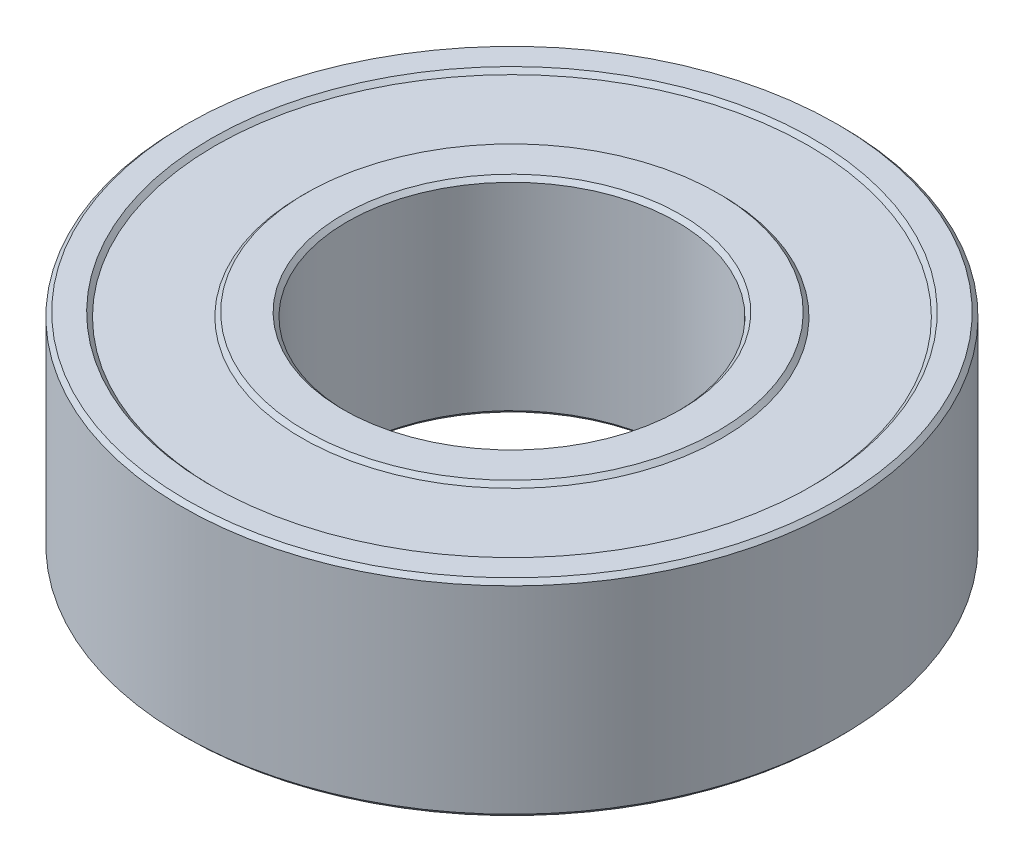
ISO-10303-21;
HEADER;
FILE_DESCRIPTION(('STEP AP214'),'2;1');
FILE_NAME('part.step','',(''),(''),'','','');
FILE_SCHEMA(('AUTOMOTIVE_DESIGN { 1 0 10303 214 1 1 1 1 }'));
ENDSEC;
DATA;
#1=APPLICATION_CONTEXT('core data for automotive mechanical design processes');
#2=APPLICATION_PROTOCOL_DEFINITION('international standard','automotive_design',2000,#1);
#3=PRODUCT_CONTEXT('',#1,'mechanical');
#4=PRODUCT('Part','Part','',(#3));
#5=PRODUCT_RELATED_PRODUCT_CATEGORY('part','',(#4));
#6=PRODUCT_DEFINITION_FORMATION('','',#4);
#7=PRODUCT_DEFINITION_CONTEXT('part definition',#1,'design');
#8=PRODUCT_DEFINITION('design','',#6,#7);
#9=PRODUCT_DEFINITION_SHAPE('','',#8);
#10=(LENGTH_UNIT() NAMED_UNIT(*) SI_UNIT(.MILLI.,.METRE.));
#11=(NAMED_UNIT(*) PLANE_ANGLE_UNIT() SI_UNIT($,.RADIAN.));
#12=(NAMED_UNIT(*) SI_UNIT($,.STERADIAN.) SOLID_ANGLE_UNIT());
#13=UNCERTAINTY_MEASURE_WITH_UNIT(LENGTH_MEASURE(1.E-05),#10,'distance_accuracy_value','');
#14=(GEOMETRIC_REPRESENTATION_CONTEXT(3) GLOBAL_UNCERTAINTY_ASSIGNED_CONTEXT((#13)) GLOBAL_UNIT_ASSIGNED_CONTEXT((#10,
#11,#12)) REPRESENTATION_CONTEXT('',''));
#15=CARTESIAN_POINT('',(0.,0.,0.));
#16=DIRECTION('',(0.,0.,1.));
#17=DIRECTION('',(1.,0.,0.));
#18=AXIS2_PLACEMENT_3D('',#15,#16,#17);
#19=CARTESIAN_POINT('',(0.,4.95,0.));
#20=DIRECTION('',(0.,1.,0.));
#21=DIRECTION('',(-1.,0.,0.));
#22=AXIS2_PLACEMENT_3D('',#19,#20,#21);
#23=CONICAL_SURFACE('',#22,4.05,0.785398163397448);
#24=CARTESIAN_POINT('',(0.,5.,0.));
#25=DIRECTION('',(0.,1.,0.));
#26=DIRECTION('',(-1.,0.,0.));
#27=AXIS2_PLACEMENT_3D('',#24,#25,#26);
#28=CIRCLE('',#27,4.1);
#29=CARTESIAN_POINT('',(4.1,5.,0.));
#30=VERTEX_POINT('',#29);
#31=EDGE_CURVE('P0_E11',#30,#30,#28,.T.);
#32=ORIENTED_EDGE('',*,*,#31,.T.);
#33=DIRECTION('',(-0.707106781186548,-0.707106781186548,0.));
#34=VECTOR('',#33,1.);
#35=CARTESIAN_POINT('',(4.05,4.95,0.));
#36=LINE('',#35,#34);
#37=CARTESIAN_POINT('',(4.,4.9,0.));
#38=VERTEX_POINT('',#37);
#39=EDGE_CURVE('P0_E27',#30,#38,#36,.T.);
#40=ORIENTED_EDGE('',*,*,#39,.T.);
#41=CARTESIAN_POINT('',(0.,4.9,0.));
#42=DIRECTION('',(0.,-1.,0.));
#43=DIRECTION('',(-1.,0.,0.));
#44=AXIS2_PLACEMENT_3D('',#41,#42,#43);
#45=CIRCLE('',#44,4.);
#46=CARTESIAN_POINT('',(-4.,4.9,0.));
#47=VERTEX_POINT('',#46);
#48=EDGE_CURVE('P0_E20',#38,#47,#45,.T.);
#49=ORIENTED_EDGE('',*,*,#48,.T.);
#50=CARTESIAN_POINT('',(0.,4.9,0.));
#51=DIRECTION('',(0.,-1.,0.));
#52=DIRECTION('',(-1.,0.,0.));
#53=AXIS2_PLACEMENT_3D('',#50,#51,#52);
#54=CIRCLE('',#53,4.);
#55=EDGE_CURVE('P0_E118',#47,#38,#54,.T.);
#56=ORIENTED_EDGE('',*,*,#55,.T.);
#57=ORIENTED_EDGE('',*,*,#39,.F.);
#58=EDGE_LOOP('',(#32,#40,#49,#56,#57));
#59=FACE_BOUND('',#58,.T.);
#60=ADVANCED_FACE('P0_F16',(#59),#23,.F.);
#61=CARTESIAN_POINT('',(0.,5.,0.));
#62=DIRECTION('',(0.,1.,0.));
#63=DIRECTION('',(1.,0.,0.));
#64=AXIS2_PLACEMENT_3D('',#61,#62,#63);
#65=PLANE('',#64);
#66=CARTESIAN_POINT('',(0.,5.,0.));
#67=DIRECTION('',(0.,-1.,0.));
#68=DIRECTION('',(-1.,0.,0.));
#69=AXIS2_PLACEMENT_3D('',#66,#67,#68);
#70=CIRCLE('',#69,5.);
#71=CARTESIAN_POINT('',(5.,5.,0.));
#72=VERTEX_POINT('',#71);
#73=EDGE_CURVE('P0_E130',#72,#72,#70,.T.);
#74=ORIENTED_EDGE('',*,*,#73,.F.);
#75=EDGE_LOOP('',(#74));
#76=FACE_BOUND('',#75,.T.);
#77=ORIENTED_EDGE('',*,*,#31,.F.);
#78=EDGE_LOOP('',(#77));
#79=FACE_BOUND('',#78,.T.);
#80=ADVANCED_FACE('P0_F296',(#76,#79),#65,.T.);
#81=CARTESIAN_POINT('',(0.,0.,0.));
#82=DIRECTION('',(0.,1.,0.));
#83=DIRECTION('',(1.,0.,0.));
#84=AXIS2_PLACEMENT_3D('',#81,#82,#83);
#85=CYLINDRICAL_SURFACE('',#84,4.);
#86=ORIENTED_EDGE('',*,*,#48,.F.);
#87=ORIENTED_EDGE('',*,*,#55,.F.);
#88=DIRECTION('',(0.,-1.,0.));
#89=VECTOR('',#88,1.);
#90=CARTESIAN_POINT('',(-4.,0.,0.));
#91=LINE('',#90,#89);
#92=CARTESIAN_POINT('',(-4.,0.1,0.));
#93=VERTEX_POINT('',#92);
#94=EDGE_CURVE('P0_E122',#47,#93,#91,.T.);
#95=ORIENTED_EDGE('',*,*,#94,.T.);
#96=CARTESIAN_POINT('',(0.,0.1,0.));
#97=DIRECTION('',(0.,1.,0.));
#98=DIRECTION('',(1.,0.,0.));
#99=AXIS2_PLACEMENT_3D('',#96,#97,#98);
#100=CIRCLE('',#99,4.);
#101=EDGE_CURVE('P0_E183',#93,#93,#100,.T.);
#102=ORIENTED_EDGE('',*,*,#101,.F.);
#103=ORIENTED_EDGE('',*,*,#94,.F.);
#104=EDGE_LOOP('',(#86,#87,#95,#102,#103));
#105=FACE_BOUND('',#104,.T.);
#106=ADVANCED_FACE('P0_F205',(#105),#85,.F.);
#107=CARTESIAN_POINT('',(0.,4.95,0.));
#108=DIRECTION('',(0.,-1.,0.));
#109=DIRECTION('',(-1.,0.,0.));
#110=AXIS2_PLACEMENT_3D('',#107,#108,#109);
#111=CONICAL_SURFACE('',#110,5.05,0.785398163397448);
#112=ORIENTED_EDGE('',*,*,#73,.T.);
#113=DIRECTION('',(0.707106781186548,-0.707106781186548,0.));
#114=VECTOR('',#113,1.);
#115=CARTESIAN_POINT('',(5.05,4.95,0.));
#116=LINE('',#115,#114);
#117=CARTESIAN_POINT('',(5.1,4.9,0.));
#118=VERTEX_POINT('',#117);
#119=EDGE_CURVE('P0_E140',#72,#118,#116,.T.);
#120=ORIENTED_EDGE('',*,*,#119,.T.);
#121=CARTESIAN_POINT('',(0.,4.9,0.));
#122=DIRECTION('',(0.,1.,0.));
#123=DIRECTION('',(-1.,0.,0.));
#124=AXIS2_PLACEMENT_3D('',#121,#122,#123);
#125=CIRCLE('',#124,5.1);
#126=EDGE_CURVE('P0_E150',#118,#118,#125,.T.);
#127=ORIENTED_EDGE('',*,*,#126,.T.);
#128=ORIENTED_EDGE('',*,*,#119,.F.);
#129=EDGE_LOOP('',(#112,#120,#127,#128));
#130=FACE_BOUND('',#129,.T.);
#131=ADVANCED_FACE('P0_F328',(#130),#111,.T.);
#132=CARTESIAN_POINT('',(0.,4.,0.));
#133=DIRECTION('',(0.,1.,0.));
#134=DIRECTION('',(-1.,0.,0.));
#135=AXIS2_PLACEMENT_3D('',#132,#133,#134);
#136=CYLINDRICAL_SURFACE('',#135,5.1);
#137=ORIENTED_EDGE('',*,*,#126,.F.);
#138=DIRECTION('',(0.,-1.,0.));
#139=VECTOR('',#138,1.);
#140=CARTESIAN_POINT('',(5.1,4.,0.));
#141=LINE('',#140,#139);
#142=CARTESIAN_POINT('',(5.1,4.,0.));
#143=VERTEX_POINT('',#142);
#144=EDGE_CURVE('P0_E158',#118,#143,#141,.T.);
#145=ORIENTED_EDGE('',*,*,#144,.T.);
#146=CARTESIAN_POINT('',(0.,4.,0.));
#147=DIRECTION('',(0.,-1.,0.));
#148=DIRECTION('',(-1.,0.,0.));
#149=AXIS2_PLACEMENT_3D('',#146,#147,#148);
#150=CIRCLE('',#149,5.1);
#151=EDGE_CURVE('P0_E92',#143,#143,#150,.T.);
#152=ORIENTED_EDGE('',*,*,#151,.F.);
#153=ORIENTED_EDGE('',*,*,#144,.F.);
#154=EDGE_LOOP('',(#137,#145,#152,#153));
#155=FACE_BOUND('',#154,.T.);
#156=ADVANCED_FACE('P0_F332',(#155),#136,.T.);
#157=CARTESIAN_POINT('',(0.,0.05,0.));
#158=DIRECTION('',(0.,1.,0.));
#159=DIRECTION('',(1.,0.,0.));
#160=AXIS2_PLACEMENT_3D('',#157,#158,#159);
#161=CONICAL_SURFACE('',#160,5.05,0.785398163397449);
#162=CARTESIAN_POINT('',(0.,0.1,0.));
#163=DIRECTION('',(0.,-1.,0.));
#164=DIRECTION('',(1.,0.,0.));
#165=AXIS2_PLACEMENT_3D('',#162,#163,#164);
#166=CIRCLE('',#165,5.1);
#167=CARTESIAN_POINT('',(-5.1,0.1,0.));
#168=VERTEX_POINT('',#167);
#169=EDGE_CURVE('P0_E155',#168,#168,#166,.T.);
#170=ORIENTED_EDGE('',*,*,#169,.T.);
#171=DIRECTION('',(0.707106781186548,-0.707106781186547,0.));
#172=VECTOR('',#171,1.);
#173=CARTESIAN_POINT('',(-5.05,0.05,0.));
#174=LINE('',#173,#172);
#175=CARTESIAN_POINT('',(-5.,0.,0.));
#176=VERTEX_POINT('',#175);
#177=EDGE_CURVE('P0_E104',#168,#176,#174,.T.);
#178=ORIENTED_EDGE('',*,*,#177,.T.);
#179=CARTESIAN_POINT('',(0.,0.,0.));
#180=DIRECTION('',(0.,1.,0.));
#181=DIRECTION('',(1.,0.,0.));
#182=AXIS2_PLACEMENT_3D('',#179,#180,#181);
#183=CIRCLE('',#182,5.);
#184=EDGE_CURVE('P0_E100',#176,#176,#183,.T.);
#185=ORIENTED_EDGE('',*,*,#184,.T.);
#186=ORIENTED_EDGE('',*,*,#177,.F.);
#187=EDGE_LOOP('',(#170,#178,#185,#186));
#188=FACE_BOUND('',#187,.T.);
#189=ADVANCED_FACE('P0_F350',(#188),#161,.T.);
#190=CARTESIAN_POINT('',(0.,0.,0.));
#191=DIRECTION('',(0.,1.,0.));
#192=DIRECTION('',(1.,0.,0.));
#193=AXIS2_PLACEMENT_3D('',#190,#191,#192);
#194=PLANE('',#193);
#195=ORIENTED_EDGE('',*,*,#184,.F.);
#196=EDGE_LOOP('',(#195));
#197=FACE_BOUND('',#196,.T.);
#198=CARTESIAN_POINT('',(0.,0.,0.));
#199=DIRECTION('',(0.,-1.,0.));
#200=DIRECTION('',(1.,0.,0.));
#201=AXIS2_PLACEMENT_3D('',#198,#199,#200);
#202=CIRCLE('',#201,4.1);
#203=CARTESIAN_POINT('',(-4.1,0.,0.));
#204=VERTEX_POINT('',#203);
#205=EDGE_CURVE('P0_E108',#204,#204,#202,.T.);
#206=ORIENTED_EDGE('',*,*,#205,.F.);
#207=EDGE_LOOP('',(#206));
#208=FACE_BOUND('',#207,.T.);
#209=ADVANCED_FACE('P0_F322',(#197,#208),#194,.F.);
#210=CARTESIAN_POINT('',(0.,0.,0.));
#211=DIRECTION('',(0.,1.,0.));
#212=DIRECTION('',(1.,0.,0.));
#213=AXIS2_PLACEMENT_3D('',#210,#211,#212);
#214=CYLINDRICAL_SURFACE('',#213,5.1);
#215=CARTESIAN_POINT('',(0.,1.,0.));
#216=DIRECTION('',(0.,1.,0.));
#217=DIRECTION('',(1.,0.,0.));
#218=AXIS2_PLACEMENT_3D('',#215,#216,#217);
#219=CIRCLE('',#218,5.1);
#220=CARTESIAN_POINT('',(-5.1,1.,0.));
#221=VERTEX_POINT('',#220);
#222=EDGE_CURVE('P0_E77',#221,#221,#219,.T.);
#223=ORIENTED_EDGE('',*,*,#222,.F.);
#224=DIRECTION('',(0.,-1.,0.));
#225=VECTOR('',#224,1.);
#226=CARTESIAN_POINT('',(-5.1,0.,0.));
#227=LINE('',#226,#225);
#228=EDGE_CURVE('P0_E80',#221,#168,#227,.T.);
#229=ORIENTED_EDGE('',*,*,#228,.T.);
#230=ORIENTED_EDGE('',*,*,#169,.F.);
#231=ORIENTED_EDGE('',*,*,#228,.F.);
#232=EDGE_LOOP('',(#223,#229,#230,#231));
#233=FACE_BOUND('',#232,.T.);
#234=ADVANCED_FACE('P0_F78',(#233),#214,.T.);
#235=CARTESIAN_POINT('',(0.,0.05,0.));
#236=DIRECTION('',(0.,-1.,0.));
#237=DIRECTION('',(1.,0.,0.));
#238=AXIS2_PLACEMENT_3D('',#235,#236,#237);
#239=CONICAL_SURFACE('',#238,4.05,0.785398163397449);
#240=ORIENTED_EDGE('',*,*,#101,.T.);
#241=DIRECTION('',(-0.707106781186548,-0.707106781186547,0.));
#242=VECTOR('',#241,1.);
#243=CARTESIAN_POINT('',(-4.05,0.05,0.));
#244=LINE('',#243,#242);
#245=EDGE_CURVE('P0_E112',#93,#204,#244,.T.);
#246=ORIENTED_EDGE('',*,*,#245,.T.);
#247=ORIENTED_EDGE('',*,*,#205,.T.);
#248=ORIENTED_EDGE('',*,*,#245,.F.);
#249=EDGE_LOOP('',(#240,#246,#247,#248));
#250=FACE_BOUND('',#249,.T.);
#251=ADVANCED_FACE('P0_F202',(#250),#239,.F.);
#252=CARTESIAN_POINT('',(0.,3.25,0.));
#253=DIRECTION('',(0.,1.,0.));
#254=DIRECTION('',(1.,0.,0.));
#255=AXIS2_PLACEMENT_3D('',#252,#253,#254);
#256=PLANE('',#255);
#257=CARTESIAN_POINT('',(0.,3.25,0.));
#258=DIRECTION('',(0.,1.,0.));
#259=DIRECTION('',(-1.,0.,0.));
#260=AXIS2_PLACEMENT_3D('',#257,#258,#259);
#261=CIRCLE('',#260,5.9);
#262=CARTESIAN_POINT('',(5.9,3.25,0.));
#263=VERTEX_POINT('',#262);
#264=EDGE_CURVE('P0_E123',#263,#263,#261,.T.);
#265=ORIENTED_EDGE('',*,*,#264,.F.);
#266=EDGE_LOOP('',(#265));
#267=FACE_BOUND('',#266,.T.);
#268=CARTESIAN_POINT('',(0.,3.25,0.));
#269=DIRECTION('',(0.,1.,0.));
#270=DIRECTION('',(-1.,0.,0.));
#271=AXIS2_PLACEMENT_3D('',#268,#269,#270);
#272=CIRCLE('',#271,5.4);
#273=CARTESIAN_POINT('',(5.4,3.25,0.));
#274=VERTEX_POINT('',#273);
#275=EDGE_CURVE('P0_E113',#274,#274,#272,.T.);
#276=ORIENTED_EDGE('',*,*,#275,.T.);
#277=EDGE_LOOP('',(#276));
#278=FACE_BOUND('',#277,.T.);
#279=ADVANCED_FACE('P0_F341',(#267,#278),#256,.F.);
#280=CARTESIAN_POINT('',(0.,3.25,0.));
#281=DIRECTION('',(0.,1.,0.));
#282=DIRECTION('',(-1.,0.,0.));
#283=AXIS2_PLACEMENT_3D('',#280,#281,#282);
#284=CYLINDRICAL_SURFACE('',#283,5.9);
#285=CARTESIAN_POINT('',(0.,4.,0.));
#286=DIRECTION('',(0.,1.,0.));
#287=DIRECTION('',(-1.,0.,0.));
#288=AXIS2_PLACEMENT_3D('',#285,#286,#287);
#289=CIRCLE('',#288,5.9);
#290=CARTESIAN_POINT('',(5.9,4.,0.));
#291=VERTEX_POINT('',#290);
#292=EDGE_CURVE('P0_E117',#291,#291,#289,.T.);
#293=ORIENTED_EDGE('',*,*,#292,.F.);
#294=DIRECTION('',(0.,-1.,0.));
#295=VECTOR('',#294,1.);
#296=CARTESIAN_POINT('',(5.9,3.25,0.));
#297=LINE('',#296,#295);
#298=EDGE_CURVE('P0_E127',#291,#263,#297,.T.);
#299=ORIENTED_EDGE('',*,*,#298,.T.);
#300=ORIENTED_EDGE('',*,*,#264,.T.);
#301=ORIENTED_EDGE('',*,*,#298,.F.);
#302=EDGE_LOOP('',(#293,#299,#300,#301));
#303=FACE_BOUND('',#302,.T.);
#304=ADVANCED_FACE('P0_F18',(#303),#284,.T.);
#305=CARTESIAN_POINT('',(0.,4.,0.));
#306=DIRECTION('',(0.,1.,0.));
#307=DIRECTION('',(1.,0.,0.));
#308=AXIS2_PLACEMENT_3D('',#305,#306,#307);
#309=PLANE('',#308);
#310=ORIENTED_EDGE('',*,*,#292,.T.);
#311=EDGE_LOOP('',(#310));
#312=FACE_BOUND('',#311,.T.);
#313=ORIENTED_EDGE('',*,*,#151,.T.);
#314=EDGE_LOOP('',(#313));
#315=FACE_BOUND('',#314,.T.);
#316=ADVANCED_FACE('P0_F410',(#312,#315),#309,.T.);
#317=CARTESIAN_POINT('',(0.,1.75,0.));
#318=DIRECTION('',(0.,1.,0.));
#319=DIRECTION('',(-1.,0.,0.));
#320=AXIS2_PLACEMENT_3D('',#317,#318,#319);
#321=CYLINDRICAL_SURFACE('',#320,5.4);
#322=ORIENTED_EDGE('',*,*,#275,.F.);
#323=DIRECTION('',(0.,-1.,0.));
#324=VECTOR('',#323,1.);
#325=CARTESIAN_POINT('',(5.4,1.75,0.));
#326=LINE('',#325,#324);
#327=CARTESIAN_POINT('',(5.4,1.75,0.));
#328=VERTEX_POINT('',#327);
#329=EDGE_CURVE('P0_E83',#274,#328,#326,.T.);
#330=ORIENTED_EDGE('',*,*,#329,.T.);
#331=CARTESIAN_POINT('',(0.,1.75,0.));
#332=DIRECTION('',(0.,-1.,0.));
#333=DIRECTION('',(-1.,0.,0.));
#334=AXIS2_PLACEMENT_3D('',#331,#332,#333);
#335=CIRCLE('',#334,5.4);
#336=EDGE_CURVE('P0_E167',#328,#328,#335,.T.);
#337=ORIENTED_EDGE('',*,*,#336,.F.);
#338=ORIENTED_EDGE('',*,*,#329,.F.);
#339=EDGE_LOOP('',(#322,#330,#337,#338));
#340=FACE_BOUND('',#339,.T.);
#341=ADVANCED_FACE('P0_F235',(#340),#321,.T.);
#342=CARTESIAN_POINT('',(0.,1.,0.));
#343=DIRECTION('',(0.,1.,0.));
#344=DIRECTION('',(1.,0.,0.));
#345=AXIS2_PLACEMENT_3D('',#342,#343,#344);
#346=PLANE('',#345);
#347=CARTESIAN_POINT('',(0.,1.,0.));
#348=DIRECTION('',(0.,1.,0.));
#349=DIRECTION('',(-1.,0.,0.));
#350=AXIS2_PLACEMENT_3D('',#347,#348,#349);
#351=CIRCLE('',#350,5.6);
#352=CARTESIAN_POINT('',(5.6,1.,0.));
#353=VERTEX_POINT('',#352);
#354=EDGE_CURVE('P0_E95',#353,#353,#351,.T.);
#355=ORIENTED_EDGE('',*,*,#354,.F.);
#356=EDGE_LOOP('',(#355));
#357=FACE_BOUND('',#356,.T.);
#358=ORIENTED_EDGE('',*,*,#222,.T.);
#359=EDGE_LOOP('',(#358));
#360=FACE_BOUND('',#359,.T.);
#361=ADVANCED_FACE('P0_F357',(#357,#360),#346,.F.);
#362=CARTESIAN_POINT('',(0.,1.,0.));
#363=DIRECTION('',(0.,1.,0.));
#364=DIRECTION('',(-1.,0.,0.));
#365=AXIS2_PLACEMENT_3D('',#362,#363,#364);
#366=CYLINDRICAL_SURFACE('',#365,5.6);
#367=CARTESIAN_POINT('',(0.,1.75,0.));
#368=DIRECTION('',(0.,1.,0.));
#369=DIRECTION('',(-1.,0.,0.));
#370=AXIS2_PLACEMENT_3D('',#367,#368,#369);
#371=CIRCLE('',#370,5.6);
#372=CARTESIAN_POINT('',(5.6,1.75,0.));
#373=VERTEX_POINT('',#372);
#374=EDGE_CURVE('P0_E98',#373,#373,#371,.T.);
#375=ORIENTED_EDGE('',*,*,#374,.F.);
#376=DIRECTION('',(0.,-1.,0.));
#377=VECTOR('',#376,1.);
#378=CARTESIAN_POINT('',(5.6,1.,0.));
#379=LINE('',#378,#377);
#380=EDGE_CURVE('P0_E84',#373,#353,#379,.T.);
#381=ORIENTED_EDGE('',*,*,#380,.T.);
#382=ORIENTED_EDGE('',*,*,#354,.T.);
#383=ORIENTED_EDGE('',*,*,#380,.F.);
#384=EDGE_LOOP('',(#375,#381,#382,#383));
#385=FACE_BOUND('',#384,.T.);
#386=ADVANCED_FACE('P0_F313',(#385),#366,.T.);
#387=CARTESIAN_POINT('',(0.,1.75,0.));
#388=DIRECTION('',(0.,1.,0.));
#389=DIRECTION('',(1.,0.,0.));
#390=AXIS2_PLACEMENT_3D('',#387,#388,#389);
#391=PLANE('',#390);
#392=ORIENTED_EDGE('',*,*,#374,.T.);
#393=EDGE_LOOP('',(#392));
#394=FACE_BOUND('',#393,.T.);
#395=ORIENTED_EDGE('',*,*,#336,.T.);
#396=EDGE_LOOP('',(#395));
#397=FACE_BOUND('',#396,.T.);
#398=ADVANCED_FACE('P0_F309',(#394,#397),#391,.T.);
#399=CLOSED_SHELL('',(#60,#80,#106,#131,#156,#189,#209,#234,#251,#279,#304,#316,#341,#361,#386,#398));
#400=MANIFOLD_SOLID_BREP('P0_B1',#399);
#401=CARTESIAN_POINT('',(0.,4.95,0.));
#402=DIRECTION('',(0.,-1.,0.));
#403=DIRECTION('',(1.,0.,0.));
#404=AXIS2_PLACEMENT_3D('',#401,#402,#403);
#405=CONICAL_SURFACE('',#404,7.95,0.785398163397448);
#406=CARTESIAN_POINT('',(0.,5.,0.));
#407=DIRECTION('',(0.,-1.,0.));
#408=DIRECTION('',(1.,0.,0.));
#409=AXIS2_PLACEMENT_3D('',#406,#407,#408);
#410=CIRCLE('',#409,7.9);
#411=CARTESIAN_POINT('',(-7.9,5.,0.));
#412=VERTEX_POINT('',#411);
#413=EDGE_CURVE('P1_E11',#412,#412,#410,.T.);
#414=ORIENTED_EDGE('',*,*,#413,.T.);
#415=DIRECTION('',(-0.707106781186548,-0.707106781186548,0.));
#416=VECTOR('',#415,1.);
#417=CARTESIAN_POINT('',(-7.95,4.95,0.));
#418=LINE('',#417,#416);
#419=CARTESIAN_POINT('',(-8.,4.9,0.));
#420=VERTEX_POINT('',#419);
#421=EDGE_CURVE('P1_E27',#412,#420,#418,.T.);
#422=ORIENTED_EDGE('',*,*,#421,.T.);
#423=CARTESIAN_POINT('',(0.,4.9,0.));
#424=DIRECTION('',(0.,1.,0.));
#425=DIRECTION('',(1.,0.,0.));
#426=AXIS2_PLACEMENT_3D('',#423,#424,#425);
#427=CIRCLE('',#426,8.);
#428=EDGE_CURVE('P1_E90',#420,#420,#427,.T.);
#429=ORIENTED_EDGE('',*,*,#428,.T.);
#430=ORIENTED_EDGE('',*,*,#421,.F.);
#431=EDGE_LOOP('',(#414,#422,#429,#430));
#432=FACE_BOUND('',#431,.T.);
#433=ADVANCED_FACE('P1_F16',(#432),#405,.T.);
#434=CARTESIAN_POINT('',(0.,5.,0.));
#435=DIRECTION('',(0.,1.,0.));
#436=DIRECTION('',(1.,0.,0.));
#437=AXIS2_PLACEMENT_3D('',#434,#435,#436);
#438=PLANE('',#437);
#439=ORIENTED_EDGE('',*,*,#413,.F.);
#440=EDGE_LOOP('',(#439));
#441=FACE_BOUND('',#440,.T.);
#442=CARTESIAN_POINT('',(0.,5.,0.));
#443=DIRECTION('',(0.,1.,0.));
#444=DIRECTION('',(1.,0.,0.));
#445=AXIS2_PLACEMENT_3D('',#442,#443,#444);
#446=CIRCLE('',#445,7.3);
#447=CARTESIAN_POINT('',(-7.3,5.,0.));
#448=VERTEX_POINT('',#447);
#449=EDGE_CURVE('P1_E105',#448,#448,#446,.T.);
#450=ORIENTED_EDGE('',*,*,#449,.F.);
#451=EDGE_LOOP('',(#450));
#452=FACE_BOUND('',#451,.T.);
#453=ADVANCED_FACE('P1_F131',(#441,#452),#438,.T.);
#454=CARTESIAN_POINT('',(0.,0.,0.));
#455=DIRECTION('',(0.,1.,0.));
#456=DIRECTION('',(1.,0.,0.));
#457=AXIS2_PLACEMENT_3D('',#454,#455,#456);
#458=CYLINDRICAL_SURFACE('',#457,8.);
#459=ORIENTED_EDGE('',*,*,#428,.F.);
#460=DIRECTION('',(0.,-1.,0.));
#461=VECTOR('',#460,1.);
#462=CARTESIAN_POINT('',(-8.,0.,0.));
#463=LINE('',#462,#461);
#464=CARTESIAN_POINT('',(-8.,0.1,0.));
#465=VERTEX_POINT('',#464);
#466=EDGE_CURVE('P1_E104',#420,#465,#463,.T.);
#467=ORIENTED_EDGE('',*,*,#466,.T.);
#468=CARTESIAN_POINT('',(0.,0.1,0.));
#469=DIRECTION('',(0.,-1.,0.));
#470=DIRECTION('',(1.,0.,0.));
#471=AXIS2_PLACEMENT_3D('',#468,#469,#470);
#472=CIRCLE('',#471,8.);
#473=EDGE_CURVE('P1_E77',#465,#465,#472,.T.);
#474=ORIENTED_EDGE('',*,*,#473,.F.);
#475=ORIENTED_EDGE('',*,*,#466,.F.);
#476=EDGE_LOOP('',(#459,#467,#474,#475));
#477=FACE_BOUND('',#476,.T.);
#478=ADVANCED_FACE('P1_F137',(#477),#458,.T.);
#479=CARTESIAN_POINT('',(0.,4.95,0.));
#480=DIRECTION('',(0.,1.,0.));
#481=DIRECTION('',(1.,0.,0.));
#482=AXIS2_PLACEMENT_3D('',#479,#480,#481);
#483=CONICAL_SURFACE('',#482,7.25,0.785398163397448);
#484=ORIENTED_EDGE('',*,*,#449,.T.);
#485=DIRECTION('',(0.707106781186548,-0.707106781186548,0.));
#486=VECTOR('',#485,1.);
#487=CARTESIAN_POINT('',(-7.25,4.95,0.));
#488=LINE('',#487,#486);
#489=CARTESIAN_POINT('',(-7.2,4.9,0.));
#490=VERTEX_POINT('',#489);
#491=EDGE_CURVE('P1_E20',#448,#490,#488,.T.);
#492=ORIENTED_EDGE('',*,*,#491,.T.);
#493=CARTESIAN_POINT('',(0.,4.9,0.));
#494=DIRECTION('',(0.,-1.,0.));
#495=DIRECTION('',(1.,0.,0.));
#496=AXIS2_PLACEMENT_3D('',#493,#494,#495);
#497=CIRCLE('',#496,7.2);
#498=EDGE_CURVE('P1_E97',#490,#490,#497,.T.);
#499=ORIENTED_EDGE('',*,*,#498,.T.);
#500=ORIENTED_EDGE('',*,*,#491,.F.);
#501=EDGE_LOOP('',(#484,#492,#499,#500));
#502=FACE_BOUND('',#501,.T.);
#503=ADVANCED_FACE('P1_F140',(#502),#483,.F.);
#504=CARTESIAN_POINT('',(0.,0.,0.));
#505=DIRECTION('',(0.,1.,0.));
#506=DIRECTION('',(1.,0.,0.));
#507=AXIS2_PLACEMENT_3D('',#504,#505,#506);
#508=CYLINDRICAL_SURFACE('',#507,7.2);
#509=ORIENTED_EDGE('',*,*,#498,.F.);
#510=DIRECTION('',(0.,-1.,0.));
#511=VECTOR('',#510,1.);
#512=CARTESIAN_POINT('',(-7.2,0.,0.));
#513=LINE('',#512,#511);
#514=CARTESIAN_POINT('',(-7.2,0.1,0.));
#515=VERTEX_POINT('',#514);
#516=EDGE_CURVE('P1_E81',#490,#515,#513,.T.);
#517=ORIENTED_EDGE('',*,*,#516,.T.);
#518=CARTESIAN_POINT('',(0.,0.1,0.));
#519=DIRECTION('',(0.,1.,0.));
#520=DIRECTION('',(1.,0.,0.));
#521=AXIS2_PLACEMENT_3D('',#518,#519,#520);
#522=CIRCLE('',#521,7.2);
#523=EDGE_CURVE('P1_E74',#515,#515,#522,.T.);
#524=ORIENTED_EDGE('',*,*,#523,.F.);
#525=ORIENTED_EDGE('',*,*,#516,.F.);
#526=EDGE_LOOP('',(#509,#517,#524,#525));
#527=FACE_BOUND('',#526,.T.);
#528=ADVANCED_FACE('P1_F117',(#527),#508,.F.);
#529=CARTESIAN_POINT('',(0.,0.05,0.));
#530=DIRECTION('',(0.,1.,0.));
#531=DIRECTION('',(1.,0.,0.));
#532=AXIS2_PLACEMENT_3D('',#529,#530,#531);
#533=CONICAL_SURFACE('',#532,7.95,0.785398163397449);
#534=ORIENTED_EDGE('',*,*,#473,.T.);
#535=DIRECTION('',(0.707106781186548,-0.707106781186547,0.));
#536=VECTOR('',#535,1.);
#537=CARTESIAN_POINT('',(-7.95,0.05,0.));
#538=LINE('',#537,#536);
#539=CARTESIAN_POINT('',(-7.9,0.,0.));
#540=VERTEX_POINT('',#539);
#541=EDGE_CURVE('P1_E82',#465,#540,#538,.T.);
#542=ORIENTED_EDGE('',*,*,#541,.T.);
#543=CARTESIAN_POINT('',(0.,0.,0.));
#544=DIRECTION('',(0.,1.,0.));
#545=DIRECTION('',(1.,0.,0.));
#546=AXIS2_PLACEMENT_3D('',#543,#544,#545);
#547=CIRCLE('',#546,7.9);
#548=EDGE_CURVE('P1_E83',#540,#540,#547,.T.);
#549=ORIENTED_EDGE('',*,*,#548,.T.);
#550=ORIENTED_EDGE('',*,*,#541,.F.);
#551=EDGE_LOOP('',(#534,#542,#549,#550));
#552=FACE_BOUND('',#551,.T.);
#553=ADVANCED_FACE('P1_F126',(#552),#533,.T.);
#554=CARTESIAN_POINT('',(0.,0.,0.));
#555=DIRECTION('',(0.,1.,0.));
#556=DIRECTION('',(1.,0.,0.));
#557=AXIS2_PLACEMENT_3D('',#554,#555,#556);
#558=PLANE('',#557);
#559=ORIENTED_EDGE('',*,*,#548,.F.);
#560=EDGE_LOOP('',(#559));
#561=FACE_BOUND('',#560,.T.);
#562=CARTESIAN_POINT('',(0.,0.,0.));
#563=DIRECTION('',(0.,-1.,0.));
#564=DIRECTION('',(1.,0.,0.));
#565=AXIS2_PLACEMENT_3D('',#562,#563,#564);
#566=CIRCLE('',#565,7.3);
#567=CARTESIAN_POINT('',(-7.3,0.,0.));
#568=VERTEX_POINT('',#567);
#569=EDGE_CURVE('P1_E63',#568,#568,#566,.T.);
#570=ORIENTED_EDGE('',*,*,#569,.F.);
#571=EDGE_LOOP('',(#570));
#572=FACE_BOUND('',#571,.T.);
#573=ADVANCED_FACE('P1_F18',(#561,#572),#558,.F.);
#574=CARTESIAN_POINT('',(0.,0.05,0.));
#575=DIRECTION('',(0.,-1.,0.));
#576=DIRECTION('',(1.,0.,0.));
#577=AXIS2_PLACEMENT_3D('',#574,#575,#576);
#578=CONICAL_SURFACE('',#577,7.25,0.785398163397449);
#579=ORIENTED_EDGE('',*,*,#523,.T.);
#580=DIRECTION('',(-0.707106781186548,-0.707106781186547,0.));
#581=VECTOR('',#580,1.);
#582=CARTESIAN_POINT('',(-7.25,0.05,0.));
#583=LINE('',#582,#581);
#584=EDGE_CURVE('P1_E68',#515,#568,#583,.T.);
#585=ORIENTED_EDGE('',*,*,#584,.T.);
#586=ORIENTED_EDGE('',*,*,#569,.T.);
#587=ORIENTED_EDGE('',*,*,#584,.F.);
#588=EDGE_LOOP('',(#579,#585,#586,#587));
#589=FACE_BOUND('',#588,.T.);
#590=ADVANCED_FACE('P1_F118',(#589),#578,.F.);
#591=CLOSED_SHELL('',(#433,#453,#478,#503,#528,#553,#573,#590));
#592=MANIFOLD_SOLID_BREP('P1_B1',#591);
#593=CARTESIAN_POINT('',(0.,0.1,0.));
#594=DIRECTION('',(0.,-1.,0.));
#595=DIRECTION('',(0.,0.,-1.));
#596=AXIS2_PLACEMENT_3D('',#593,#594,#595);
#597=PLANE('',#596);
#598=CARTESIAN_POINT('',(0.,0.1,0.));
#599=DIRECTION('',(0.,-1.,0.));
#600=DIRECTION('',(1.,0.,0.));
#601=AXIS2_PLACEMENT_3D('',#598,#599,#600);
#602=CIRCLE('',#601,7.5);
#603=CARTESIAN_POINT('',(-7.5,0.1,0.));
#604=VERTEX_POINT('',#603);
#605=EDGE_CURVE('P2_E11',#604,#604,#602,.T.);
#606=ORIENTED_EDGE('',*,*,#605,.T.);
#607=EDGE_LOOP('',(#606));
#608=FACE_BOUND('',#607,.T.);
#609=CARTESIAN_POINT('',(0.,0.1,0.));
#610=DIRECTION('',(0.,1.,0.));
#611=DIRECTION('',(1.,0.,0.));
#612=AXIS2_PLACEMENT_3D('',#609,#610,#611);
#613=CIRCLE('',#612,5.1);
#614=CARTESIAN_POINT('',(-5.1,0.1,0.));
#615=VERTEX_POINT('',#614);
#616=EDGE_CURVE('P2_E25',#615,#615,#613,.T.);
#617=ORIENTED_EDGE('',*,*,#616,.T.);
#618=EDGE_LOOP('',(#617));
#619=FACE_BOUND('',#618,.T.);
#620=ADVANCED_FACE('P2_F16',(#608,#619),#597,.T.);
#621=CARTESIAN_POINT('',(0.,0.8,0.));
#622=DIRECTION('',(0.,-1.,0.));
#623=DIRECTION('',(1.,0.,0.));
#624=AXIS2_PLACEMENT_3D('',#621,#622,#623);
#625=CYLINDRICAL_SURFACE('',#624,5.1);
#626=ORIENTED_EDGE('',*,*,#616,.F.);
#627=DIRECTION('',(0.,1.,0.));
#628=VECTOR('',#627,1.);
#629=CARTESIAN_POINT('',(-5.1,0.8,0.));
#630=LINE('',#629,#628);
#631=CARTESIAN_POINT('',(-5.1,0.8,0.));
#632=VERTEX_POINT('',#631);
#633=EDGE_CURVE('P2_E68',#615,#632,#630,.T.);
#634=ORIENTED_EDGE('',*,*,#633,.T.);
#635=CARTESIAN_POINT('',(0.,0.8,0.));
#636=DIRECTION('',(0.,1.,0.));
#637=DIRECTION('',(1.,0.,0.));
#638=AXIS2_PLACEMENT_3D('',#635,#636,#637);
#639=CIRCLE('',#638,5.1);
#640=EDGE_CURVE('P2_E61',#632,#632,#639,.T.);
#641=ORIENTED_EDGE('',*,*,#640,.T.);
#642=ORIENTED_EDGE('',*,*,#633,.F.);
#643=EDGE_LOOP('',(#626,#634,#641,#642));
#644=FACE_BOUND('',#643,.T.);
#645=ADVANCED_FACE('P2_F18',(#644),#625,.F.);
#646=CARTESIAN_POINT('',(0.,0.8,0.));
#647=DIRECTION('',(0.,-1.,0.));
#648=DIRECTION('',(1.,0.,0.));
#649=AXIS2_PLACEMENT_3D('',#646,#647,#648);
#650=CYLINDRICAL_SURFACE('',#649,7.5);
#651=ORIENTED_EDGE('',*,*,#605,.F.);
#652=DIRECTION('',(0.,1.,0.));
#653=VECTOR('',#652,1.);
#654=CARTESIAN_POINT('',(-7.5,0.8,0.));
#655=LINE('',#654,#653);
#656=CARTESIAN_POINT('',(-7.5,0.8,0.));
#657=VERTEX_POINT('',#656);
#658=EDGE_CURVE('P2_E57',#604,#657,#655,.T.);
#659=ORIENTED_EDGE('',*,*,#658,.T.);
#660=CARTESIAN_POINT('',(0.,0.8,0.));
#661=DIRECTION('',(0.,-1.,0.));
#662=DIRECTION('',(1.,0.,0.));
#663=AXIS2_PLACEMENT_3D('',#660,#661,#662);
#664=CIRCLE('',#663,7.5);
#665=EDGE_CURVE('P2_E53',#657,#657,#664,.T.);
#666=ORIENTED_EDGE('',*,*,#665,.T.);
#667=ORIENTED_EDGE('',*,*,#658,.F.);
#668=EDGE_LOOP('',(#651,#659,#666,#667));
#669=FACE_BOUND('',#668,.T.);
#670=ADVANCED_FACE('P2_F59',(#669),#650,.T.);
#671=CARTESIAN_POINT('',(0.,0.8,0.));
#672=DIRECTION('',(0.,-1.,0.));
#673=DIRECTION('',(0.,0.,-1.));
#674=AXIS2_PLACEMENT_3D('',#671,#672,#673);
#675=PLANE('',#674);
#676=ORIENTED_EDGE('',*,*,#665,.F.);
#677=EDGE_LOOP('',(#676));
#678=FACE_BOUND('',#677,.T.);
#679=ORIENTED_EDGE('',*,*,#640,.F.);
#680=EDGE_LOOP('',(#679));
#681=FACE_BOUND('',#680,.T.);
#682=ADVANCED_FACE('P2_F54',(#678,#681),#675,.F.);
#683=CLOSED_SHELL('',(#620,#645,#670,#682));
#684=MANIFOLD_SOLID_BREP('P2_B1',#683);
#685=CARTESIAN_POINT('',(0.,4.9,0.));
#686=DIRECTION('',(0.,1.,0.));
#687=DIRECTION('',(1.,0.,0.));
#688=AXIS2_PLACEMENT_3D('',#685,#686,#687);
#689=PLANE('',#688);
#690=CARTESIAN_POINT('',(0.,4.9,0.));
#691=DIRECTION('',(0.,1.,0.));
#692=DIRECTION('',(-1.,0.,0.));
#693=AXIS2_PLACEMENT_3D('',#690,#691,#692);
#694=CIRCLE('',#693,7.5);
#695=CARTESIAN_POINT('',(7.5,4.9,0.));
#696=VERTEX_POINT('',#695);
#697=EDGE_CURVE('P3_E11',#696,#696,#694,.T.);
#698=ORIENTED_EDGE('',*,*,#697,.T.);
#699=EDGE_LOOP('',(#698));
#700=FACE_BOUND('',#699,.T.);
#701=CARTESIAN_POINT('',(0.,4.9,0.));
#702=DIRECTION('',(0.,-1.,0.));
#703=DIRECTION('',(-1.,0.,0.));
#704=AXIS2_PLACEMENT_3D('',#701,#702,#703);
#705=CIRCLE('',#704,5.1);
#706=CARTESIAN_POINT('',(5.1,4.9,0.));
#707=VERTEX_POINT('',#706);
#708=EDGE_CURVE('P3_E27',#707,#707,#705,.T.);
#709=ORIENTED_EDGE('',*,*,#708,.T.);
#710=EDGE_LOOP('',(#709));
#711=FACE_BOUND('',#710,.T.);
#712=ADVANCED_FACE('P3_F16',(#700,#711),#689,.T.);
#713=CARTESIAN_POINT('',(0.,4.4,0.));
#714=DIRECTION('',(0.,1.,0.));
#715=DIRECTION('',(-1.,0.,0.));
#716=AXIS2_PLACEMENT_3D('',#713,#714,#715);
#717=CYLINDRICAL_SURFACE('',#716,5.1);
#718=ORIENTED_EDGE('',*,*,#708,.F.);
#719=DIRECTION('',(0.,-1.,0.));
#720=VECTOR('',#719,1.);
#721=CARTESIAN_POINT('',(5.1,4.4,0.));
#722=LINE('',#721,#720);
#723=CARTESIAN_POINT('',(5.1,4.4,0.));
#724=VERTEX_POINT('',#723);
#725=EDGE_CURVE('P3_E54',#707,#724,#722,.T.);
#726=ORIENTED_EDGE('',*,*,#725,.T.);
#727=CARTESIAN_POINT('',(0.,4.4,0.));
#728=DIRECTION('',(0.,-1.,0.));
#729=DIRECTION('',(-1.,0.,0.));
#730=AXIS2_PLACEMENT_3D('',#727,#728,#729);
#731=CIRCLE('',#730,5.1);
#732=EDGE_CURVE('P3_E20',#724,#724,#731,.T.);
#733=ORIENTED_EDGE('',*,*,#732,.T.);
#734=ORIENTED_EDGE('',*,*,#725,.F.);
#735=EDGE_LOOP('',(#718,#726,#733,#734));
#736=FACE_BOUND('',#735,.T.);
#737=ADVANCED_FACE('P3_F56',(#736),#717,.F.);
#738=CARTESIAN_POINT('',(0.,4.4,0.));
#739=DIRECTION('',(0.,1.,0.));
#740=DIRECTION('',(-1.,0.,0.));
#741=AXIS2_PLACEMENT_3D('',#738,#739,#740);
#742=CYLINDRICAL_SURFACE('',#741,7.5);
#743=ORIENTED_EDGE('',*,*,#697,.F.);
#744=DIRECTION('',(0.,-1.,0.));
#745=VECTOR('',#744,1.);
#746=CARTESIAN_POINT('',(7.5,4.4,0.));
#747=LINE('',#746,#745);
#748=CARTESIAN_POINT('',(7.5,4.4,0.));
#749=VERTEX_POINT('',#748);
#750=EDGE_CURVE('P3_E55',#696,#749,#747,.T.);
#751=ORIENTED_EDGE('',*,*,#750,.T.);
#752=CARTESIAN_POINT('',(0.,4.4,0.));
#753=DIRECTION('',(0.,1.,0.));
#754=DIRECTION('',(-1.,0.,0.));
#755=AXIS2_PLACEMENT_3D('',#752,#753,#754);
#756=CIRCLE('',#755,7.5);
#757=EDGE_CURVE('P3_E66',#749,#749,#756,.T.);
#758=ORIENTED_EDGE('',*,*,#757,.T.);
#759=ORIENTED_EDGE('',*,*,#750,.F.);
#760=EDGE_LOOP('',(#743,#751,#758,#759));
#761=FACE_BOUND('',#760,.T.);
#762=ADVANCED_FACE('P3_F72',(#761),#742,.T.);
#763=CARTESIAN_POINT('',(0.,4.4,0.));
#764=DIRECTION('',(0.,1.,0.));
#765=DIRECTION('',(1.,0.,0.));
#766=AXIS2_PLACEMENT_3D('',#763,#764,#765);
#767=PLANE('',#766);
#768=ORIENTED_EDGE('',*,*,#757,.F.);
#769=EDGE_LOOP('',(#768));
#770=FACE_BOUND('',#769,.T.);
#771=ORIENTED_EDGE('',*,*,#732,.F.);
#772=EDGE_LOOP('',(#771));
#773=FACE_BOUND('',#772,.T.);
#774=ADVANCED_FACE('P3_F18',(#770,#773),#767,.F.);
#775=CLOSED_SHELL('',(#712,#737,#762,#774));
#776=MANIFOLD_SOLID_BREP('P3_B1',#775);
#777=ADVANCED_BREP_SHAPE_REPRESENTATION('',(#18,#400,#592,#684,#776),#14);
#778=SHAPE_DEFINITION_REPRESENTATION(#9,#777);
ENDSEC;
END-ISO-10303-21;
